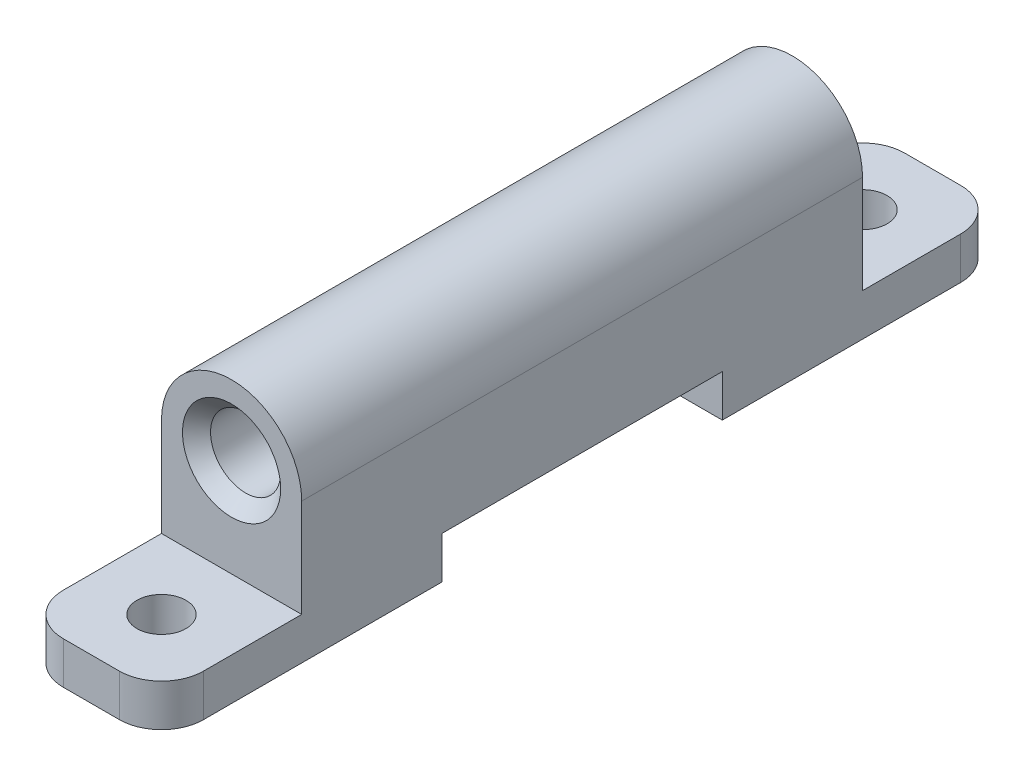
ISO-10303-21;
HEADER;
FILE_DESCRIPTION(('STEP AP214'),'2;1');
FILE_NAME('part.step','',(''),(''),'','','');
FILE_SCHEMA(('AUTOMOTIVE_DESIGN { 1 0 10303 214 1 1 1 1 }'));
ENDSEC;
DATA;
#1=APPLICATION_CONTEXT('core data for automotive mechanical design processes');
#2=APPLICATION_PROTOCOL_DEFINITION('international standard','automotive_design',2000,#1);
#3=PRODUCT_CONTEXT('',#1,'mechanical');
#4=PRODUCT('Part','Part','',(#3));
#5=PRODUCT_RELATED_PRODUCT_CATEGORY('part','',(#4));
#6=PRODUCT_DEFINITION_FORMATION('','',#4);
#7=PRODUCT_DEFINITION_CONTEXT('part definition',#1,'design');
#8=PRODUCT_DEFINITION('design','',#6,#7);
#9=PRODUCT_DEFINITION_SHAPE('','',#8);
#10=(LENGTH_UNIT() NAMED_UNIT(*) SI_UNIT(.MILLI.,.METRE.));
#11=(NAMED_UNIT(*) PLANE_ANGLE_UNIT() SI_UNIT($,.RADIAN.));
#12=(NAMED_UNIT(*) SI_UNIT($,.STERADIAN.) SOLID_ANGLE_UNIT());
#13=UNCERTAINTY_MEASURE_WITH_UNIT(LENGTH_MEASURE(1.E-05),#10,'distance_accuracy_value','');
#14=(GEOMETRIC_REPRESENTATION_CONTEXT(3) GLOBAL_UNCERTAINTY_ASSIGNED_CONTEXT((#13)) GLOBAL_UNIT_ASSIGNED_CONTEXT((#10,
#11,#12)) REPRESENTATION_CONTEXT('',''));
#15=CARTESIAN_POINT('',(0.,0.,0.));
#16=DIRECTION('',(0.,0.,1.));
#17=DIRECTION('',(1.,0.,0.));
#18=AXIS2_PLACEMENT_3D('',#15,#16,#17);
#19=CARTESIAN_POINT('',(-5.,0.,20.));
#20=DIRECTION('',(0.,1.,0.));
#21=DIRECTION('',(0.,0.,1.));
#22=AXIS2_PLACEMENT_3D('',#19,#20,#21);
#23=PLANE('',#22);
#24=DIRECTION('',(0.,0.,-1.));
#25=VECTOR('',#24,1.);
#26=CARTESIAN_POINT('',(-5.,0.,20.));
#27=LINE('',#26,#25);
#28=CARTESIAN_POINT('',(-5.,0.,10.));
#29=VERTEX_POINT('',#28);
#30=CARTESIAN_POINT('',(-5.,0.,-10.));
#31=VERTEX_POINT('',#30);
#32=EDGE_CURVE('E244',#29,#31,#27,.T.);
#33=ORIENTED_EDGE('',*,*,#32,.T.);
#34=DIRECTION('',(1.,0.,0.));
#35=VECTOR('',#34,1.);
#36=CARTESIAN_POINT('',(-5.,0.,-10.));
#37=LINE('',#36,#35);
#38=CARTESIAN_POINT('',(5.,0.,-10.));
#39=VERTEX_POINT('',#38);
#40=EDGE_CURVE('E185',#31,#39,#37,.T.);
#41=ORIENTED_EDGE('',*,*,#40,.T.);
#42=DIRECTION('',(0.,0.,-1.));
#43=VECTOR('',#42,1.);
#44=CARTESIAN_POINT('',(5.,0.,20.));
#45=LINE('',#44,#43);
#46=CARTESIAN_POINT('',(5.,0.,10.));
#47=VERTEX_POINT('',#46);
#48=EDGE_CURVE('E157',#47,#39,#45,.T.);
#49=ORIENTED_EDGE('',*,*,#48,.F.);
#50=DIRECTION('',(1.,0.,0.));
#51=VECTOR('',#50,1.);
#52=CARTESIAN_POINT('',(-5.,0.,10.));
#53=LINE('',#52,#51);
#54=EDGE_CURVE('E207',#29,#47,#53,.T.);
#55=ORIENTED_EDGE('',*,*,#54,.F.);
#56=EDGE_LOOP('',(#33,#41,#49,#55));
#57=FACE_BOUND('',#56,.T.);
#58=ADVANCED_FACE('F35',(#57),#23,.F.);
#59=CARTESIAN_POINT('',(0.,7.,20.));
#60=DIRECTION('',(0.,0.,1.));
#61=DIRECTION('',(1.,0.,0.));
#62=AXIS2_PLACEMENT_3D('',#59,#60,#61);
#63=PLANE('',#62);
#64=CARTESIAN_POINT('',(0.,7.,20.));
#65=DIRECTION('',(0.,0.,1.));
#66=DIRECTION('',(1.,0.,0.));
#67=AXIS2_PLACEMENT_3D('',#64,#65,#66);
#68=CIRCLE('',#67,3.50000000000001);
#69=CARTESIAN_POINT('',(3.50000000000001,7.,20.));
#70=VERTEX_POINT('',#69);
#71=EDGE_CURVE('E11',#70,#70,#68,.F.);
#72=ORIENTED_EDGE('',*,*,#71,.T.);
#73=EDGE_LOOP('',(#72));
#74=FACE_BOUND('',#73,.T.);
#75=CARTESIAN_POINT('',(0.,7.,20.));
#76=DIRECTION('',(0.,0.,1.));
#77=DIRECTION('',(1.,0.,0.));
#78=AXIS2_PLACEMENT_3D('',#75,#76,#77);
#79=CIRCLE('',#78,5.);
#80=CARTESIAN_POINT('',(5.,7.,20.));
#81=VERTEX_POINT('',#80);
#82=CARTESIAN_POINT('',(-5.,7.,20.));
#83=VERTEX_POINT('',#82);
#84=EDGE_CURVE('E220',#81,#83,#79,.T.);
#85=ORIENTED_EDGE('',*,*,#84,.T.);
#86=DIRECTION('',(0.,-1.,0.));
#87=VECTOR('',#86,1.);
#88=CARTESIAN_POINT('',(-5.,0.,20.));
#89=LINE('',#88,#87);
#90=CARTESIAN_POINT('',(-5.,0.,20.));
#91=VERTEX_POINT('',#90);
#92=EDGE_CURVE('E223',#83,#91,#89,.T.);
#93=ORIENTED_EDGE('',*,*,#92,.T.);
#94=DIRECTION('',(1.,0.,0.));
#95=VECTOR('',#94,1.);
#96=CARTESIAN_POINT('',(-5.,0.,20.));
#97=LINE('',#96,#95);
#98=CARTESIAN_POINT('',(5.,0.,20.));
#99=VERTEX_POINT('',#98);
#100=EDGE_CURVE('E227',#91,#99,#97,.T.);
#101=ORIENTED_EDGE('',*,*,#100,.T.);
#102=DIRECTION('',(0.,1.,0.));
#103=VECTOR('',#102,1.);
#104=CARTESIAN_POINT('',(5.,0.,20.));
#105=LINE('',#104,#103);
#106=EDGE_CURVE('E229',#99,#81,#105,.T.);
#107=ORIENTED_EDGE('',*,*,#106,.T.);
#108=EDGE_LOOP('',(#85,#93,#101,#107));
#109=FACE_BOUND('',#108,.T.);
#110=ADVANCED_FACE('F304',(#74,#109),#63,.T.);
#111=CARTESIAN_POINT('',(0.,7.,-20.));
#112=DIRECTION('',(0.,0.,1.));
#113=DIRECTION('',(1.,0.,0.));
#114=AXIS2_PLACEMENT_3D('',#111,#112,#113);
#115=PLANE('',#114);
#116=CARTESIAN_POINT('',(0.,7.,-20.));
#117=DIRECTION('',(0.,0.,1.));
#118=DIRECTION('',(1.,0.,0.));
#119=AXIS2_PLACEMENT_3D('',#116,#117,#118);
#120=CIRCLE('',#119,3.5);
#121=CARTESIAN_POINT('',(3.5,7.,-20.));
#122=VERTEX_POINT('',#121);
#123=EDGE_CURVE('E283',#122,#122,#120,.T.);
#124=ORIENTED_EDGE('',*,*,#123,.T.);
#125=EDGE_LOOP('',(#124));
#126=FACE_BOUND('',#125,.T.);
#127=CARTESIAN_POINT('',(0.,7.,-20.));
#128=DIRECTION('',(0.,0.,1.));
#129=DIRECTION('',(1.,0.,0.));
#130=AXIS2_PLACEMENT_3D('',#127,#128,#129);
#131=CIRCLE('',#130,5.);
#132=CARTESIAN_POINT('',(5.,7.,-20.));
#133=VERTEX_POINT('',#132);
#134=CARTESIAN_POINT('',(-5.,7.,-20.));
#135=VERTEX_POINT('',#134);
#136=EDGE_CURVE('E219',#133,#135,#131,.T.);
#137=ORIENTED_EDGE('',*,*,#136,.F.);
#138=DIRECTION('',(0.,1.,0.));
#139=VECTOR('',#138,1.);
#140=CARTESIAN_POINT('',(5.,0.,-20.));
#141=LINE('',#140,#139);
#142=CARTESIAN_POINT('',(5.,0.,-20.));
#143=VERTEX_POINT('',#142);
#144=EDGE_CURVE('E224',#143,#133,#141,.T.);
#145=ORIENTED_EDGE('',*,*,#144,.F.);
#146=DIRECTION('',(1.,0.,0.));
#147=VECTOR('',#146,1.);
#148=CARTESIAN_POINT('',(-5.,0.,-20.));
#149=LINE('',#148,#147);
#150=CARTESIAN_POINT('',(-5.,0.,-20.));
#151=VERTEX_POINT('',#150);
#152=EDGE_CURVE('E237',#151,#143,#149,.T.);
#153=ORIENTED_EDGE('',*,*,#152,.F.);
#154=DIRECTION('',(0.,-1.,0.));
#155=VECTOR('',#154,1.);
#156=CARTESIAN_POINT('',(-5.,0.,-20.));
#157=LINE('',#156,#155);
#158=EDGE_CURVE('E234',#135,#151,#157,.T.);
#159=ORIENTED_EDGE('',*,*,#158,.F.);
#160=EDGE_LOOP('',(#137,#145,#153,#159));
#161=FACE_BOUND('',#160,.T.);
#162=ADVANCED_FACE('F300',(#126,#161),#115,.F.);
#163=CARTESIAN_POINT('',(0.,7.,20.));
#164=DIRECTION('',(0.,0.,-1.));
#165=DIRECTION('',(-1.,0.,0.));
#166=AXIS2_PLACEMENT_3D('',#163,#164,#165);
#167=CYLINDRICAL_SURFACE('',#166,5.);
#168=ORIENTED_EDGE('',*,*,#136,.T.);
#169=DIRECTION('',(0.,0.,-1.));
#170=VECTOR('',#169,1.);
#171=CARTESIAN_POINT('',(-5.,7.,20.));
#172=LINE('',#171,#170);
#173=EDGE_CURVE('E247',#83,#135,#172,.T.);
#174=ORIENTED_EDGE('',*,*,#173,.F.);
#175=ORIENTED_EDGE('',*,*,#84,.F.);
#176=DIRECTION('',(0.,0.,-1.));
#177=VECTOR('',#176,1.);
#178=CARTESIAN_POINT('',(5.,7.,20.));
#179=LINE('',#178,#177);
#180=EDGE_CURVE('E231',#81,#133,#179,.T.);
#181=ORIENTED_EDGE('',*,*,#180,.T.);
#182=EDGE_LOOP('',(#168,#174,#175,#181));
#183=FACE_BOUND('',#182,.T.);
#184=ADVANCED_FACE('F303',(#183),#167,.T.);
#185=CARTESIAN_POINT('',(-5.,0.,20.));
#186=DIRECTION('',(1.,0.,0.));
#187=DIRECTION('',(0.,0.,-1.));
#188=AXIS2_PLACEMENT_3D('',#185,#186,#187);
#189=PLANE('',#188);
#190=DIRECTION('',(0.,0.,1.));
#191=VECTOR('',#190,1.);
#192=CARTESIAN_POINT('',(-5.,0.,-10.));
#193=LINE('',#192,#191);
#194=CARTESIAN_POINT('',(-5.,0.,-27.));
#195=VERTEX_POINT('',#194);
#196=EDGE_CURVE('E176',#195,#151,#193,.T.);
#197=ORIENTED_EDGE('',*,*,#196,.F.);
#198=DIRECTION('',(0.,1.,0.));
#199=VECTOR('',#198,1.);
#200=CARTESIAN_POINT('',(-5.,-3.,-27.));
#201=LINE('',#200,#199);
#202=CARTESIAN_POINT('',(-5.,-3.,-27.));
#203=VERTEX_POINT('',#202);
#204=EDGE_CURVE('E59',#195,#203,#201,.F.);
#205=ORIENTED_EDGE('',*,*,#204,.T.);
#206=DIRECTION('',(0.,0.,1.));
#207=VECTOR('',#206,1.);
#208=CARTESIAN_POINT('',(-5.,-3.,-10.));
#209=LINE('',#208,#207);
#210=CARTESIAN_POINT('',(-5.,-3.,-10.));
#211=VERTEX_POINT('',#210);
#212=EDGE_CURVE('E186',#203,#211,#209,.T.);
#213=ORIENTED_EDGE('',*,*,#212,.T.);
#214=DIRECTION('',(0.,1.,0.));
#215=VECTOR('',#214,1.);
#216=CARTESIAN_POINT('',(-5.,-3.,-10.));
#217=LINE('',#216,#215);
#218=EDGE_CURVE('E163',#211,#31,#217,.T.);
#219=ORIENTED_EDGE('',*,*,#218,.T.);
#220=ORIENTED_EDGE('',*,*,#32,.F.);
#221=DIRECTION('',(0.,1.,0.));
#222=VECTOR('',#221,1.);
#223=CARTESIAN_POINT('',(-5.,-3.,10.));
#224=LINE('',#223,#222);
#225=CARTESIAN_POINT('',(-5.,-3.,10.));
#226=VERTEX_POINT('',#225);
#227=EDGE_CURVE('E216',#226,#29,#224,.T.);
#228=ORIENTED_EDGE('',*,*,#227,.F.);
#229=DIRECTION('',(0.,0.,-1.));
#230=VECTOR('',#229,1.);
#231=CARTESIAN_POINT('',(-5.,-3.,10.));
#232=LINE('',#231,#230);
#233=CARTESIAN_POINT('',(-5.,-3.,27.));
#234=VERTEX_POINT('',#233);
#235=EDGE_CURVE('E194',#234,#226,#232,.T.);
#236=ORIENTED_EDGE('',*,*,#235,.F.);
#237=DIRECTION('',(0.,1.,0.));
#238=VECTOR('',#237,1.);
#239=CARTESIAN_POINT('',(-5.,0.,27.));
#240=LINE('',#239,#238);
#241=CARTESIAN_POINT('',(-5.,0.,27.));
#242=VERTEX_POINT('',#241);
#243=EDGE_CURVE('E250',#234,#242,#240,.T.);
#244=ORIENTED_EDGE('',*,*,#243,.T.);
#245=DIRECTION('',(0.,0.,-1.));
#246=VECTOR('',#245,1.);
#247=CARTESIAN_POINT('',(-5.,0.,10.));
#248=LINE('',#247,#246);
#249=EDGE_CURVE('E191',#242,#91,#248,.T.);
#250=ORIENTED_EDGE('',*,*,#249,.T.);
#251=ORIENTED_EDGE('',*,*,#92,.F.);
#252=ORIENTED_EDGE('',*,*,#173,.T.);
#253=ORIENTED_EDGE('',*,*,#158,.T.);
#254=EDGE_LOOP('',(#197,#205,#213,#219,#220,#228,#236,#244,#250,#251,#252,#253));
#255=FACE_BOUND('',#254,.T.);
#256=ADVANCED_FACE('F317',(#255),#189,.F.);
#257=CARTESIAN_POINT('',(5.,0.,20.));
#258=DIRECTION('',(-1.,0.,0.));
#259=DIRECTION('',(0.,0.,1.));
#260=AXIS2_PLACEMENT_3D('',#257,#258,#259);
#261=PLANE('',#260);
#262=DIRECTION('',(0.,0.,-1.));
#263=VECTOR('',#262,1.);
#264=CARTESIAN_POINT('',(5.,-3.,-10.));
#265=LINE('',#264,#263);
#266=CARTESIAN_POINT('',(5.,-3.,-10.));
#267=VERTEX_POINT('',#266);
#268=CARTESIAN_POINT('',(5.,-3.,-27.));
#269=VERTEX_POINT('',#268);
#270=EDGE_CURVE('E154',#267,#269,#265,.T.);
#271=ORIENTED_EDGE('',*,*,#270,.T.);
#272=DIRECTION('',(0.,1.,0.));
#273=VECTOR('',#272,1.);
#274=CARTESIAN_POINT('',(5.,0.,-27.));
#275=LINE('',#274,#273);
#276=CARTESIAN_POINT('',(5.,0.,-27.));
#277=VERTEX_POINT('',#276);
#278=EDGE_CURVE('E281',#269,#277,#275,.T.);
#279=ORIENTED_EDGE('',*,*,#278,.T.);
#280=DIRECTION('',(0.,0.,-1.));
#281=VECTOR('',#280,1.);
#282=CARTESIAN_POINT('',(5.,0.,-10.));
#283=LINE('',#282,#281);
#284=EDGE_CURVE('E182',#143,#277,#283,.T.);
#285=ORIENTED_EDGE('',*,*,#284,.F.);
#286=ORIENTED_EDGE('',*,*,#144,.T.);
#287=ORIENTED_EDGE('',*,*,#180,.F.);
#288=ORIENTED_EDGE('',*,*,#106,.F.);
#289=DIRECTION('',(0.,0.,1.));
#290=VECTOR('',#289,1.);
#291=CARTESIAN_POINT('',(5.,0.,10.));
#292=LINE('',#291,#290);
#293=CARTESIAN_POINT('',(5.,0.,27.));
#294=VERTEX_POINT('',#293);
#295=EDGE_CURVE('E210',#99,#294,#292,.T.);
#296=ORIENTED_EDGE('',*,*,#295,.T.);
#297=DIRECTION('',(0.,1.,0.));
#298=VECTOR('',#297,1.);
#299=CARTESIAN_POINT('',(5.,0.,27.));
#300=LINE('',#299,#298);
#301=CARTESIAN_POINT('',(5.,-3.,27.));
#302=VERTEX_POINT('',#301);
#303=EDGE_CURVE('E266',#294,#302,#300,.F.);
#304=ORIENTED_EDGE('',*,*,#303,.T.);
#305=DIRECTION('',(0.,0.,1.));
#306=VECTOR('',#305,1.);
#307=CARTESIAN_POINT('',(5.,-3.,10.));
#308=LINE('',#307,#306);
#309=CARTESIAN_POINT('',(5.,-3.,10.));
#310=VERTEX_POINT('',#309);
#311=EDGE_CURVE('E199',#310,#302,#308,.T.);
#312=ORIENTED_EDGE('',*,*,#311,.F.);
#313=DIRECTION('',(0.,1.,0.));
#314=VECTOR('',#313,1.);
#315=CARTESIAN_POINT('',(5.,-3.,10.));
#316=LINE('',#315,#314);
#317=EDGE_CURVE('E205',#310,#47,#316,.T.);
#318=ORIENTED_EDGE('',*,*,#317,.T.);
#319=ORIENTED_EDGE('',*,*,#48,.T.);
#320=DIRECTION('',(0.,1.,0.));
#321=VECTOR('',#320,1.);
#322=CARTESIAN_POINT('',(5.,-3.,-10.));
#323=LINE('',#322,#321);
#324=EDGE_CURVE('E151',#267,#39,#323,.T.);
#325=ORIENTED_EDGE('',*,*,#324,.F.);
#326=EDGE_LOOP('',(#271,#279,#285,#286,#287,#288,#296,#304,#312,#318,#319,#325));
#327=FACE_BOUND('',#326,.T.);
#328=ADVANCED_FACE('F152',(#327),#261,.F.);
#329=CARTESIAN_POINT('',(0.,7.,20.));
#330=DIRECTION('',(0.,0.,-1.));
#331=DIRECTION('',(-1.,0.,0.));
#332=AXIS2_PLACEMENT_3D('',#329,#330,#331);
#333=CYLINDRICAL_SURFACE('',#332,2.5);
#334=CARTESIAN_POINT('',(0.,7.,-19.));
#335=DIRECTION('',(0.,0.,1.));
#336=DIRECTION('',(1.,0.,0.));
#337=AXIS2_PLACEMENT_3D('',#334,#335,#336);
#338=CIRCLE('',#337,2.5);
#339=CARTESIAN_POINT('',(2.5,7.,-19.));
#340=VERTEX_POINT('',#339);
#341=EDGE_CURVE('E44',#340,#340,#338,.F.);
#342=ORIENTED_EDGE('',*,*,#341,.T.);
#343=EDGE_LOOP('',(#342));
#344=FACE_BOUND('',#343,.T.);
#345=CARTESIAN_POINT('',(0.,7.,19.));
#346=DIRECTION('',(0.,0.,1.));
#347=DIRECTION('',(1.,0.,0.));
#348=AXIS2_PLACEMENT_3D('',#345,#346,#347);
#349=CIRCLE('',#348,2.5);
#350=CARTESIAN_POINT('',(2.5,7.,19.));
#351=VERTEX_POINT('',#350);
#352=EDGE_CURVE('E286',#351,#351,#349,.T.);
#353=ORIENTED_EDGE('',*,*,#352,.T.);
#354=EDGE_LOOP('',(#353));
#355=FACE_BOUND('',#354,.T.);
#356=ADVANCED_FACE('F291',(#344,#355),#333,.F.);
#357=CARTESIAN_POINT('',(0.,0.,0.));
#358=DIRECTION('',(0.,1.,0.));
#359=DIRECTION('',(0.,0.,1.));
#360=AXIS2_PLACEMENT_3D('',#357,#358,#359);
#361=PLANE('',#360);
#362=CARTESIAN_POINT('',(0.,0.,25.));
#363=DIRECTION('',(0.,1.,0.));
#364=DIRECTION('',(0.,0.,1.));
#365=AXIS2_PLACEMENT_3D('',#362,#363,#364);
#366=CIRCLE('',#365,1.75);
#367=CARTESIAN_POINT('',(0.,0.,26.75));
#368=VERTEX_POINT('',#367);
#369=EDGE_CURVE('E162',#368,#368,#366,.T.);
#370=ORIENTED_EDGE('',*,*,#369,.F.);
#371=EDGE_LOOP('',(#370));
#372=FACE_BOUND('',#371,.T.);
#373=ORIENTED_EDGE('',*,*,#249,.F.);
#374=CARTESIAN_POINT('',(-2.,0.,27.));
#375=DIRECTION('',(0.,1.,0.));
#376=DIRECTION('',(0.,0.,1.));
#377=AXIS2_PLACEMENT_3D('',#374,#375,#376);
#378=CIRCLE('',#377,3.);
#379=CARTESIAN_POINT('',(-2.,0.,30.));
#380=VERTEX_POINT('',#379);
#381=EDGE_CURVE('E255',#242,#380,#378,.T.);
#382=ORIENTED_EDGE('',*,*,#381,.T.);
#383=DIRECTION('',(-1.,0.,0.));
#384=VECTOR('',#383,1.);
#385=CARTESIAN_POINT('',(-5.,0.,30.));
#386=LINE('',#385,#384);
#387=CARTESIAN_POINT('',(2.,0.,30.));
#388=VERTEX_POINT('',#387);
#389=EDGE_CURVE('E197',#388,#380,#386,.T.);
#390=ORIENTED_EDGE('',*,*,#389,.F.);
#391=CARTESIAN_POINT('',(2.,0.,27.));
#392=DIRECTION('',(0.,1.,0.));
#393=DIRECTION('',(0.,0.,1.));
#394=AXIS2_PLACEMENT_3D('',#391,#392,#393);
#395=CIRCLE('',#394,3.);
#396=EDGE_CURVE('E253',#388,#294,#395,.T.);
#397=ORIENTED_EDGE('',*,*,#396,.T.);
#398=ORIENTED_EDGE('',*,*,#295,.F.);
#399=ORIENTED_EDGE('',*,*,#100,.F.);
#400=EDGE_LOOP('',(#373,#382,#390,#397,#398,#399));
#401=FACE_BOUND('',#400,.T.);
#402=ADVANCED_FACE('F322',(#372,#401),#361,.T.);
#403=CARTESIAN_POINT('',(-5.,-3.,10.));
#404=DIRECTION('',(0.,0.,1.));
#405=DIRECTION('',(1.,0.,0.));
#406=AXIS2_PLACEMENT_3D('',#403,#404,#405);
#407=PLANE('',#406);
#408=ORIENTED_EDGE('',*,*,#54,.T.);
#409=ORIENTED_EDGE('',*,*,#317,.F.);
#410=DIRECTION('',(1.,0.,0.));
#411=VECTOR('',#410,1.);
#412=CARTESIAN_POINT('',(-5.,-3.,10.));
#413=LINE('',#412,#411);
#414=EDGE_CURVE('E196',#226,#310,#413,.T.);
#415=ORIENTED_EDGE('',*,*,#414,.F.);
#416=ORIENTED_EDGE('',*,*,#227,.T.);
#417=EDGE_LOOP('',(#408,#409,#415,#416));
#418=FACE_BOUND('',#417,.T.);
#419=ADVANCED_FACE('F345',(#418),#407,.F.);
#420=CARTESIAN_POINT('',(-5.,-3.,30.));
#421=DIRECTION('',(0.,0.,-1.));
#422=DIRECTION('',(-1.,0.,0.));
#423=AXIS2_PLACEMENT_3D('',#420,#421,#422);
#424=PLANE('',#423);
#425=ORIENTED_EDGE('',*,*,#389,.T.);
#426=DIRECTION('',(0.,1.,0.));
#427=VECTOR('',#426,1.);
#428=CARTESIAN_POINT('',(-2.,-3.,30.));
#429=LINE('',#428,#427);
#430=CARTESIAN_POINT('',(-2.,-3.,30.));
#431=VERTEX_POINT('',#430);
#432=EDGE_CURVE('E260',#380,#431,#429,.F.);
#433=ORIENTED_EDGE('',*,*,#432,.T.);
#434=DIRECTION('',(-1.,0.,0.));
#435=VECTOR('',#434,1.);
#436=CARTESIAN_POINT('',(-5.,-3.,30.));
#437=LINE('',#436,#435);
#438=CARTESIAN_POINT('',(2.,-3.,30.));
#439=VERTEX_POINT('',#438);
#440=EDGE_CURVE('E202',#439,#431,#437,.T.);
#441=ORIENTED_EDGE('',*,*,#440,.F.);
#442=DIRECTION('',(0.,1.,0.));
#443=VECTOR('',#442,1.);
#444=CARTESIAN_POINT('',(2.,-3.,30.));
#445=LINE('',#444,#443);
#446=EDGE_CURVE('E257',#439,#388,#445,.T.);
#447=ORIENTED_EDGE('',*,*,#446,.T.);
#448=EDGE_LOOP('',(#425,#433,#441,#447));
#449=FACE_BOUND('',#448,.T.);
#450=ADVANCED_FACE('F335',(#449),#424,.F.);
#451=CARTESIAN_POINT('',(0.,-3.,0.));
#452=DIRECTION('',(0.,1.,0.));
#453=DIRECTION('',(0.,0.,1.));
#454=AXIS2_PLACEMENT_3D('',#451,#452,#453);
#455=PLANE('',#454);
#456=CARTESIAN_POINT('',(0.,-3.,25.));
#457=DIRECTION('',(0.,1.,0.));
#458=DIRECTION('',(0.,0.,1.));
#459=AXIS2_PLACEMENT_3D('',#456,#457,#458);
#460=CIRCLE('',#459,1.75);
#461=CARTESIAN_POINT('',(0.,-3.,26.75));
#462=VERTEX_POINT('',#461);
#463=EDGE_CURVE('E188',#462,#462,#460,.T.);
#464=ORIENTED_EDGE('',*,*,#463,.T.);
#465=EDGE_LOOP('',(#464));
#466=FACE_BOUND('',#465,.T.);
#467=ORIENTED_EDGE('',*,*,#440,.T.);
#468=CARTESIAN_POINT('',(-2.,-3.,27.));
#469=DIRECTION('',(0.,1.,0.));
#470=DIRECTION('',(0.,0.,1.));
#471=AXIS2_PLACEMENT_3D('',#468,#469,#470);
#472=CIRCLE('',#471,3.);
#473=EDGE_CURVE('E264',#431,#234,#472,.F.);
#474=ORIENTED_EDGE('',*,*,#473,.T.);
#475=ORIENTED_EDGE('',*,*,#235,.T.);
#476=ORIENTED_EDGE('',*,*,#414,.T.);
#477=ORIENTED_EDGE('',*,*,#311,.T.);
#478=CARTESIAN_POINT('',(2.,-3.,27.));
#479=DIRECTION('',(0.,1.,0.));
#480=DIRECTION('',(0.,0.,1.));
#481=AXIS2_PLACEMENT_3D('',#478,#479,#480);
#482=CIRCLE('',#481,3.);
#483=EDGE_CURVE('E262',#302,#439,#482,.F.);
#484=ORIENTED_EDGE('',*,*,#483,.T.);
#485=EDGE_LOOP('',(#467,#474,#475,#476,#477,#484));
#486=FACE_BOUND('',#485,.T.);
#487=ADVANCED_FACE('F332',(#466,#486),#455,.F.);
#488=CARTESIAN_POINT('',(0.,-3.,25.));
#489=DIRECTION('',(0.,1.,0.));
#490=DIRECTION('',(0.,0.,1.));
#491=AXIS2_PLACEMENT_3D('',#488,#489,#490);
#492=CYLINDRICAL_SURFACE('',#491,1.75);
#493=ORIENTED_EDGE('',*,*,#463,.F.);
#494=EDGE_LOOP('',(#493));
#495=FACE_BOUND('',#494,.T.);
#496=ORIENTED_EDGE('',*,*,#369,.T.);
#497=EDGE_LOOP('',(#496));
#498=FACE_BOUND('',#497,.T.);
#499=ADVANCED_FACE('F363',(#495,#498),#492,.F.);
#500=CARTESIAN_POINT('',(-2.,0.,27.));
#501=DIRECTION('',(0.,1.,0.));
#502=DIRECTION('',(0.,0.,1.));
#503=AXIS2_PLACEMENT_3D('',#500,#501,#502);
#504=CYLINDRICAL_SURFACE('',#503,3.);
#505=ORIENTED_EDGE('',*,*,#473,.F.);
#506=ORIENTED_EDGE('',*,*,#432,.F.);
#507=ORIENTED_EDGE('',*,*,#381,.F.);
#508=ORIENTED_EDGE('',*,*,#243,.F.);
#509=EDGE_LOOP('',(#505,#506,#507,#508));
#510=FACE_BOUND('',#509,.T.);
#511=ADVANCED_FACE('F338',(#510),#504,.T.);
#512=CARTESIAN_POINT('',(2.,-3.,27.));
#513=DIRECTION('',(0.,1.,0.));
#514=DIRECTION('',(0.,0.,1.));
#515=AXIS2_PLACEMENT_3D('',#512,#513,#514);
#516=CYLINDRICAL_SURFACE('',#515,3.);
#517=ORIENTED_EDGE('',*,*,#483,.F.);
#518=ORIENTED_EDGE('',*,*,#303,.F.);
#519=ORIENTED_EDGE('',*,*,#396,.F.);
#520=ORIENTED_EDGE('',*,*,#446,.F.);
#521=EDGE_LOOP('',(#517,#518,#519,#520));
#522=FACE_BOUND('',#521,.T.);
#523=ADVANCED_FACE('F328',(#522),#516,.T.);
#524=CARTESIAN_POINT('',(0.,0.,0.));
#525=DIRECTION('',(0.,1.,0.));
#526=DIRECTION('',(0.,0.,-1.));
#527=AXIS2_PLACEMENT_3D('',#524,#525,#526);
#528=PLANE('',#527);
#529=CARTESIAN_POINT('',(0.,0.,-25.));
#530=DIRECTION('',(0.,-1.,0.));
#531=DIRECTION('',(0.,0.,-1.));
#532=AXIS2_PLACEMENT_3D('',#529,#530,#531);
#533=CIRCLE('',#532,1.75);
#534=CARTESIAN_POINT('',(0.,0.,-26.75));
#535=VERTEX_POINT('',#534);
#536=EDGE_CURVE('E389',#535,#535,#533,.T.);
#537=ORIENTED_EDGE('',*,*,#536,.T.);
#538=EDGE_LOOP('',(#537));
#539=FACE_BOUND('',#538,.T.);
#540=DIRECTION('',(-1.,0.,0.));
#541=VECTOR('',#540,1.);
#542=CARTESIAN_POINT('',(-5.,0.,-30.));
#543=LINE('',#542,#541);
#544=CARTESIAN_POINT('',(2.,0.,-30.));
#545=VERTEX_POINT('',#544);
#546=CARTESIAN_POINT('',(-2.,0.,-30.));
#547=VERTEX_POINT('',#546);
#548=EDGE_CURVE('E178',#545,#547,#543,.T.);
#549=ORIENTED_EDGE('',*,*,#548,.T.);
#550=CARTESIAN_POINT('',(-2.,0.,-27.));
#551=DIRECTION('',(0.,1.,0.));
#552=DIRECTION('',(0.,0.,1.));
#553=AXIS2_PLACEMENT_3D('',#550,#551,#552);
#554=CIRCLE('',#553,3.);
#555=EDGE_CURVE('E275',#547,#195,#554,.T.);
#556=ORIENTED_EDGE('',*,*,#555,.T.);
#557=ORIENTED_EDGE('',*,*,#196,.T.);
#558=ORIENTED_EDGE('',*,*,#152,.T.);
#559=ORIENTED_EDGE('',*,*,#284,.T.);
#560=CARTESIAN_POINT('',(2.,0.,-27.));
#561=DIRECTION('',(0.,1.,0.));
#562=DIRECTION('',(0.,0.,1.));
#563=AXIS2_PLACEMENT_3D('',#560,#561,#562);
#564=CIRCLE('',#563,3.);
#565=EDGE_CURVE('E273',#277,#545,#564,.T.);
#566=ORIENTED_EDGE('',*,*,#565,.T.);
#567=EDGE_LOOP('',(#549,#556,#557,#558,#559,#566));
#568=FACE_BOUND('',#567,.T.);
#569=ADVANCED_FACE('F316',(#539,#568),#528,.T.);
#570=CARTESIAN_POINT('',(-5.,-3.,-30.));
#571=DIRECTION('',(0.,0.,-1.));
#572=DIRECTION('',(-1.,0.,0.));
#573=AXIS2_PLACEMENT_3D('',#570,#571,#572);
#574=PLANE('',#573);
#575=DIRECTION('',(-1.,0.,0.));
#576=VECTOR('',#575,1.);
#577=CARTESIAN_POINT('',(-5.,-3.,-30.));
#578=LINE('',#577,#576);
#579=CARTESIAN_POINT('',(2.,-3.,-30.));
#580=VERTEX_POINT('',#579);
#581=CARTESIAN_POINT('',(-2.,-3.,-30.));
#582=VERTEX_POINT('',#581);
#583=EDGE_CURVE('E168',#580,#582,#578,.T.);
#584=ORIENTED_EDGE('',*,*,#583,.T.);
#585=DIRECTION('',(0.,1.,0.));
#586=VECTOR('',#585,1.);
#587=CARTESIAN_POINT('',(-2.,0.,-30.));
#588=LINE('',#587,#586);
#589=EDGE_CURVE('E270',#582,#547,#588,.T.);
#590=ORIENTED_EDGE('',*,*,#589,.T.);
#591=ORIENTED_EDGE('',*,*,#548,.F.);
#592=DIRECTION('',(0.,1.,0.));
#593=VECTOR('',#592,1.);
#594=CARTESIAN_POINT('',(2.,-3.,-30.));
#595=LINE('',#594,#593);
#596=EDGE_CURVE('E268',#545,#580,#595,.F.);
#597=ORIENTED_EDGE('',*,*,#596,.T.);
#598=EDGE_LOOP('',(#584,#590,#591,#597));
#599=FACE_BOUND('',#598,.T.);
#600=ADVANCED_FACE('F384',(#599),#574,.T.);
#601=CARTESIAN_POINT('',(-5.,-3.,-10.));
#602=DIRECTION('',(0.,0.,1.));
#603=DIRECTION('',(1.,0.,0.));
#604=AXIS2_PLACEMENT_3D('',#601,#602,#603);
#605=PLANE('',#604);
#606=ORIENTED_EDGE('',*,*,#40,.F.);
#607=ORIENTED_EDGE('',*,*,#218,.F.);
#608=DIRECTION('',(1.,0.,0.));
#609=VECTOR('',#608,1.);
#610=CARTESIAN_POINT('',(-5.,-3.,-10.));
#611=LINE('',#610,#609);
#612=EDGE_CURVE('E167',#211,#267,#611,.T.);
#613=ORIENTED_EDGE('',*,*,#612,.T.);
#614=ORIENTED_EDGE('',*,*,#324,.T.);
#615=EDGE_LOOP('',(#606,#607,#613,#614));
#616=FACE_BOUND('',#615,.T.);
#617=ADVANCED_FACE('F171',(#616),#605,.T.);
#618=CARTESIAN_POINT('',(0.,-3.,0.));
#619=DIRECTION('',(0.,1.,0.));
#620=DIRECTION('',(0.,0.,-1.));
#621=AXIS2_PLACEMENT_3D('',#618,#619,#620);
#622=PLANE('',#621);
#623=CARTESIAN_POINT('',(0.,-3.,-25.));
#624=DIRECTION('',(0.,-1.,0.));
#625=DIRECTION('',(0.,0.,-1.));
#626=AXIS2_PLACEMENT_3D('',#623,#624,#625);
#627=CIRCLE('',#626,1.75);
#628=CARTESIAN_POINT('',(0.,-3.,-26.75));
#629=VERTEX_POINT('',#628);
#630=EDGE_CURVE('E179',#629,#629,#627,.T.);
#631=ORIENTED_EDGE('',*,*,#630,.F.);
#632=EDGE_LOOP('',(#631));
#633=FACE_BOUND('',#632,.T.);
#634=ORIENTED_EDGE('',*,*,#212,.F.);
#635=CARTESIAN_POINT('',(-2.,-3.,-27.));
#636=DIRECTION('',(0.,1.,0.));
#637=DIRECTION('',(0.,0.,1.));
#638=AXIS2_PLACEMENT_3D('',#635,#636,#637);
#639=CIRCLE('',#638,3.);
#640=EDGE_CURVE('E279',#203,#582,#639,.F.);
#641=ORIENTED_EDGE('',*,*,#640,.T.);
#642=ORIENTED_EDGE('',*,*,#583,.F.);
#643=CARTESIAN_POINT('',(2.,-3.,-27.));
#644=DIRECTION('',(0.,1.,0.));
#645=DIRECTION('',(0.,0.,1.));
#646=AXIS2_PLACEMENT_3D('',#643,#644,#645);
#647=CIRCLE('',#646,3.);
#648=EDGE_CURVE('E51',#580,#269,#647,.F.);
#649=ORIENTED_EDGE('',*,*,#648,.T.);
#650=ORIENTED_EDGE('',*,*,#270,.F.);
#651=ORIENTED_EDGE('',*,*,#612,.F.);
#652=EDGE_LOOP('',(#634,#641,#642,#649,#650,#651));
#653=FACE_BOUND('',#652,.T.);
#654=ADVANCED_FACE('F166',(#633,#653),#622,.F.);
#655=CARTESIAN_POINT('',(0.,-3.,-25.));
#656=DIRECTION('',(0.,1.,0.));
#657=DIRECTION('',(0.,0.,1.));
#658=AXIS2_PLACEMENT_3D('',#655,#656,#657);
#659=CYLINDRICAL_SURFACE('',#658,1.75);
#660=ORIENTED_EDGE('',*,*,#630,.T.);
#661=EDGE_LOOP('',(#660));
#662=FACE_BOUND('',#661,.T.);
#663=ORIENTED_EDGE('',*,*,#536,.F.);
#664=EDGE_LOOP('',(#663));
#665=FACE_BOUND('',#664,.T.);
#666=ADVANCED_FACE('F369',(#662,#665),#659,.F.);
#667=CARTESIAN_POINT('',(-2.,-3.,-27.));
#668=DIRECTION('',(0.,-1.,0.));
#669=DIRECTION('',(0.,0.,-1.));
#670=AXIS2_PLACEMENT_3D('',#667,#668,#669);
#671=CYLINDRICAL_SURFACE('',#670,3.);
#672=ORIENTED_EDGE('',*,*,#640,.F.);
#673=ORIENTED_EDGE('',*,*,#204,.F.);
#674=ORIENTED_EDGE('',*,*,#555,.F.);
#675=ORIENTED_EDGE('',*,*,#589,.F.);
#676=EDGE_LOOP('',(#672,#673,#674,#675));
#677=FACE_BOUND('',#676,.T.);
#678=ADVANCED_FACE('F366',(#677),#671,.T.);
#679=CARTESIAN_POINT('',(2.,0.,-27.));
#680=DIRECTION('',(0.,-1.,0.));
#681=DIRECTION('',(0.,0.,-1.));
#682=AXIS2_PLACEMENT_3D('',#679,#680,#681);
#683=CYLINDRICAL_SURFACE('',#682,3.);
#684=ORIENTED_EDGE('',*,*,#648,.F.);
#685=ORIENTED_EDGE('',*,*,#596,.F.);
#686=ORIENTED_EDGE('',*,*,#565,.F.);
#687=ORIENTED_EDGE('',*,*,#278,.F.);
#688=EDGE_LOOP('',(#684,#685,#686,#687));
#689=FACE_BOUND('',#688,.T.);
#690=ADVANCED_FACE('F297',(#689),#683,.T.);
#691=CARTESIAN_POINT('',(0.,7.,-20.));
#692=DIRECTION('',(0.,0.,-1.));
#693=DIRECTION('',(-1.,0.,0.));
#694=AXIS2_PLACEMENT_3D('',#691,#692,#693);
#695=CONICAL_SURFACE('',#694,3.5,0.785398163397445);
#696=ORIENTED_EDGE('',*,*,#341,.F.);
#697=EDGE_LOOP('',(#696));
#698=FACE_BOUND('',#697,.T.);
#699=ORIENTED_EDGE('',*,*,#123,.F.);
#700=EDGE_LOOP('',(#699));
#701=FACE_BOUND('',#700,.T.);
#702=ADVANCED_FACE('F294',(#698,#701),#695,.F.);
#703=CARTESIAN_POINT('',(0.,7.,19.));
#704=DIRECTION('',(0.,0.,1.));
#705=DIRECTION('',(1.,0.,0.));
#706=AXIS2_PLACEMENT_3D('',#703,#704,#705);
#707=CONICAL_SURFACE('',#706,2.5,0.78539816339745);
#708=ORIENTED_EDGE('',*,*,#71,.F.);
#709=EDGE_LOOP('',(#708));
#710=FACE_BOUND('',#709,.T.);
#711=ORIENTED_EDGE('',*,*,#352,.F.);
#712=EDGE_LOOP('',(#711));
#713=FACE_BOUND('',#712,.T.);
#714=ADVANCED_FACE('F38',(#710,#713),#707,.F.);
#715=CLOSED_SHELL('',(#58,#110,#162,#184,#256,#328,#356,#402,#419,#450,#487,#499,#511,#523,#569,
#600,#617,#654,#666,#678,#690,#702,#714));
#716=MANIFOLD_SOLID_BREP('B2',#715);
#717=ADVANCED_BREP_SHAPE_REPRESENTATION('',(#18,#716),#14);
#718=SHAPE_DEFINITION_REPRESENTATION(#9,#717);
ENDSEC;
END-ISO-10303-21;
